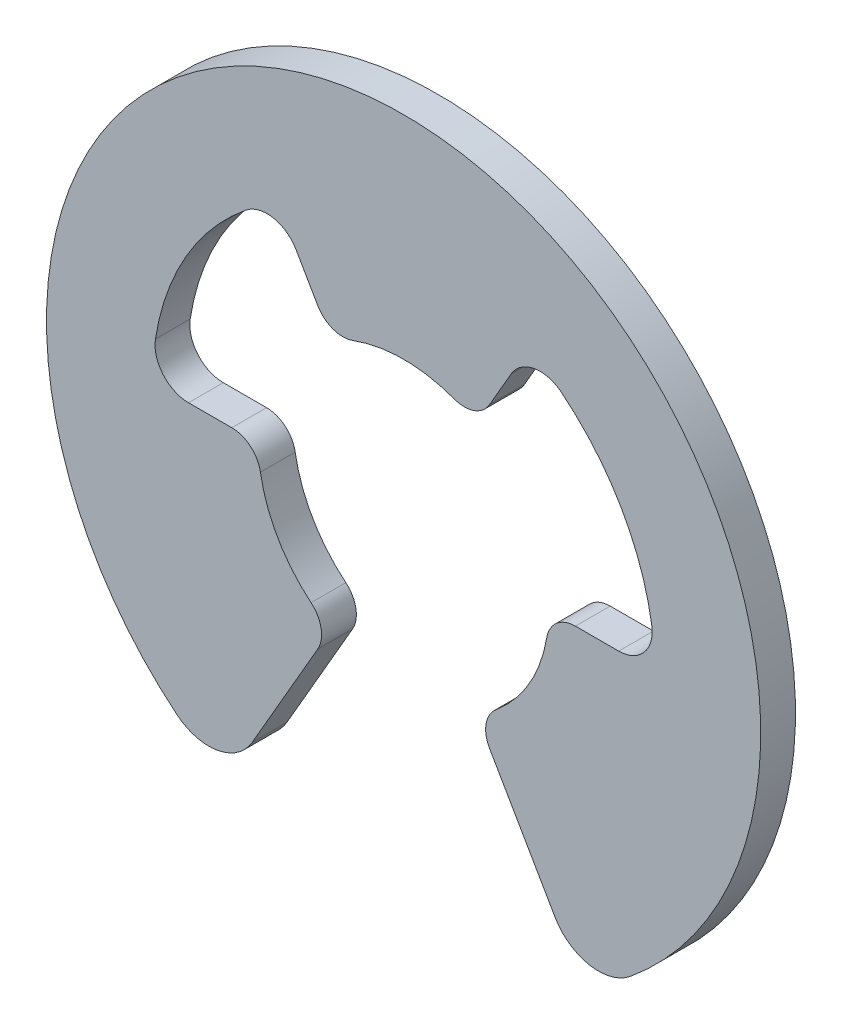
ISO-10303-21;
HEADER;
FILE_DESCRIPTION(('STEP AP214'),'2;1');
FILE_NAME('part.step','',(''),(''),'','','');
FILE_SCHEMA(('AUTOMOTIVE_DESIGN { 1 0 10303 214 1 1 1 1 }'));
ENDSEC;
DATA;
#1=APPLICATION_CONTEXT('core data for automotive mechanical design processes');
#2=APPLICATION_PROTOCOL_DEFINITION('international standard','automotive_design',2000,#1);
#3=PRODUCT_CONTEXT('',#1,'mechanical');
#4=PRODUCT('Part','Part','',(#3));
#5=PRODUCT_RELATED_PRODUCT_CATEGORY('part','',(#4));
#6=PRODUCT_DEFINITION_FORMATION('','',#4);
#7=PRODUCT_DEFINITION_CONTEXT('part definition',#1,'design');
#8=PRODUCT_DEFINITION('design','',#6,#7);
#9=PRODUCT_DEFINITION_SHAPE('','',#8);
#10=(LENGTH_UNIT() NAMED_UNIT(*) SI_UNIT(.MILLI.,.METRE.));
#11=(NAMED_UNIT(*) PLANE_ANGLE_UNIT() SI_UNIT($,.RADIAN.));
#12=(NAMED_UNIT(*) SI_UNIT($,.STERADIAN.) SOLID_ANGLE_UNIT());
#13=UNCERTAINTY_MEASURE_WITH_UNIT(LENGTH_MEASURE(1.E-05),#10,'distance_accuracy_value','');
#14=(GEOMETRIC_REPRESENTATION_CONTEXT(3) GLOBAL_UNCERTAINTY_ASSIGNED_CONTEXT((#13)) GLOBAL_UNIT_ASSIGNED_CONTEXT((#10,
#11,#12)) REPRESENTATION_CONTEXT('',''));
#15=CARTESIAN_POINT('',(0.,0.,0.));
#16=DIRECTION('',(0.,0.,1.));
#17=DIRECTION('',(1.,0.,0.));
#18=AXIS2_PLACEMENT_3D('',#15,#16,#17);
#19=CARTESIAN_POINT('',(5.19771588444956,-6.32300799517454,0.46355));
#20=DIRECTION('',(0.,0.,-1.));
#21=DIRECTION('',(-1.,0.,0.));
#22=AXIS2_PLACEMENT_3D('',#19,#20,#21);
#23=CYLINDRICAL_SURFACE('',#22,1.33984999999996);
#24=DIRECTION('',(0.,0.,-1.));
#25=VECTOR('',#24,1.);
#26=CARTESIAN_POINT('',(4.037371747189,-6.9929329951745,0.46355));
#27=LINE('',#26,#25);
#28=CARTESIAN_POINT('',(4.037371747189,-6.9929329951745,0.46355));
#29=VERTEX_POINT('',#28);
#30=CARTESIAN_POINT('',(4.037371747189,-6.9929329951745,-0.46355));
#31=VERTEX_POINT('',#30);
#32=EDGE_CURVE('E216',#29,#31,#27,.T.);
#33=ORIENTED_EDGE('',*,*,#32,.T.);
#34=CARTESIAN_POINT('',(5.19771588444956,-6.32300799517454,-0.46355));
#35=DIRECTION('',(0.,0.,1.));
#36=DIRECTION('',(1.,0.,0.));
#37=AXIS2_PLACEMENT_3D('',#34,#35,#36);
#38=CIRCLE('',#37,1.33984999999996);
#39=CARTESIAN_POINT('',(6.0485443880461,-7.35803885460221,-0.46355));
#40=VERTEX_POINT('',#39);
#41=EDGE_CURVE('E210',#31,#40,#38,.T.);
#42=ORIENTED_EDGE('',*,*,#41,.T.);
#43=DIRECTION('',(0.,0.,-1.));
#44=VECTOR('',#43,1.);
#45=CARTESIAN_POINT('',(6.0485443880461,-7.35803885460221,0.46355));
#46=LINE('',#45,#44);
#47=CARTESIAN_POINT('',(6.0485443880461,-7.35803885460221,0.46355));
#48=VERTEX_POINT('',#47);
#49=EDGE_CURVE('E11',#48,#40,#46,.T.);
#50=ORIENTED_EDGE('',*,*,#49,.F.);
#51=CARTESIAN_POINT('',(5.19771588444956,-6.32300799517454,0.46355));
#52=DIRECTION('',(0.,0.,1.));
#53=DIRECTION('',(1.,0.,0.));
#54=AXIS2_PLACEMENT_3D('',#51,#52,#53);
#55=CIRCLE('',#54,1.33984999999996);
#56=EDGE_CURVE('E282',#29,#48,#55,.T.);
#57=ORIENTED_EDGE('',*,*,#56,.F.);
#58=EDGE_LOOP('',(#33,#42,#50,#57));
#59=FACE_BOUND('',#58,.T.);
#60=ADVANCED_FACE('F38',(#59),#23,.T.);
#61=CARTESIAN_POINT('',(0.,0.,0.46355));
#62=DIRECTION('',(0.,0.,-1.));
#63=DIRECTION('',(-1.,0.,0.));
#64=AXIS2_PLACEMENT_3D('',#61,#62,#63);
#65=CYLINDRICAL_SURFACE('',#64,9.52499999999999);
#66=ORIENTED_EDGE('',*,*,#49,.T.);
#67=CARTESIAN_POINT('',(0.,0.,-0.46355));
#68=DIRECTION('',(0.,0.,1.));
#69=DIRECTION('',(1.,0.,0.));
#70=AXIS2_PLACEMENT_3D('',#67,#68,#69);
#71=CIRCLE('',#70,9.52499999999999);
#72=CARTESIAN_POINT('',(-6.04854447375821,-7.3580387841441,-0.46355));
#73=VERTEX_POINT('',#72);
#74=EDGE_CURVE('E200',#40,#73,#71,.T.);
#75=ORIENTED_EDGE('',*,*,#74,.T.);
#76=DIRECTION('',(0.,0.,-1.));
#77=VECTOR('',#76,1.);
#78=CARTESIAN_POINT('',(-6.04854447375821,-7.3580387841441,0.46355));
#79=LINE('',#78,#77);
#80=CARTESIAN_POINT('',(-6.04854447375821,-7.3580387841441,0.46355));
#81=VERTEX_POINT('',#80);
#82=EDGE_CURVE('E45',#81,#73,#79,.T.);
#83=ORIENTED_EDGE('',*,*,#82,.F.);
#84=CARTESIAN_POINT('',(0.,0.,0.46355));
#85=DIRECTION('',(0.,0.,1.));
#86=DIRECTION('',(1.,0.,0.));
#87=AXIS2_PLACEMENT_3D('',#84,#85,#86);
#88=CIRCLE('',#87,9.52499999999999);
#89=EDGE_CURVE('E201',#48,#81,#88,.T.);
#90=ORIENTED_EDGE('',*,*,#89,.F.);
#91=EDGE_LOOP('',(#66,#75,#83,#90));
#92=FACE_BOUND('',#91,.T.);
#93=ADVANCED_FACE('F198',(#92),#65,.T.);
#94=CARTESIAN_POINT('',(-5.19771588444956,-6.32300799517454,0.46355));
#95=DIRECTION('',(0.,0.,-1.));
#96=DIRECTION('',(-1.,0.,0.));
#97=AXIS2_PLACEMENT_3D('',#94,#95,#96);
#98=CYLINDRICAL_SURFACE('',#97,1.33984999999996);
#99=ORIENTED_EDGE('',*,*,#82,.T.);
#100=CARTESIAN_POINT('',(-5.19771588444956,-6.32300799517454,-0.46355));
#101=DIRECTION('',(0.,0.,1.));
#102=DIRECTION('',(1.,0.,0.));
#103=AXIS2_PLACEMENT_3D('',#100,#101,#102);
#104=CIRCLE('',#103,1.33984999999996);
#105=CARTESIAN_POINT('',(-4.037371747189,-6.9929329951745,-0.46355));
#106=VERTEX_POINT('',#105);
#107=EDGE_CURVE('E214',#73,#106,#104,.T.);
#108=ORIENTED_EDGE('',*,*,#107,.T.);
#109=DIRECTION('',(0.,0.,-1.));
#110=VECTOR('',#109,1.);
#111=CARTESIAN_POINT('',(-4.037371747189,-6.9929329951745,0.46355));
#112=LINE('',#111,#110);
#113=CARTESIAN_POINT('',(-4.037371747189,-6.9929329951745,0.46355));
#114=VERTEX_POINT('',#113);
#115=EDGE_CURVE('E368',#114,#106,#112,.T.);
#116=ORIENTED_EDGE('',*,*,#115,.F.);
#117=CARTESIAN_POINT('',(-5.19771588444956,-6.32300799517454,0.46355));
#118=DIRECTION('',(0.,0.,1.));
#119=DIRECTION('',(1.,0.,0.));
#120=AXIS2_PLACEMENT_3D('',#117,#118,#119);
#121=CIRCLE('',#120,1.33984999999996);
#122=EDGE_CURVE('E285',#81,#114,#121,.T.);
#123=ORIENTED_EDGE('',*,*,#122,.F.);
#124=EDGE_LOOP('',(#99,#108,#116,#123));
#125=FACE_BOUND('',#124,.T.);
#126=ADVANCED_FACE('F371',(#125),#98,.T.);
#127=CARTESIAN_POINT('',(-4.037371747189,-6.9929329951745,0.46355));
#128=DIRECTION('',(-0.866025403784439,0.499999999999998,0.));
#129=DIRECTION('',(-0.499999999999999,-0.86602540378444,0.));
#130=AXIS2_PLACEMENT_3D('',#127,#128,#129);
#131=PLANE('',#130);
#132=ORIENTED_EDGE('',*,*,#115,.T.);
#133=DIRECTION('',(0.499999999999998,0.866025403784439,0.));
#134=VECTOR('',#133,1.);
#135=CARTESIAN_POINT('',(-4.037371747189,-6.9929329951745,-0.46355));
#136=LINE('',#135,#134);
#137=CARTESIAN_POINT('',(-2.2915935039836,-3.9691563791944,-0.46355));
#138=VERTEX_POINT('',#137);
#139=EDGE_CURVE('E220',#106,#138,#136,.T.);
#140=ORIENTED_EDGE('',*,*,#139,.T.);
#141=DIRECTION('',(0.,0.,-1.));
#142=VECTOR('',#141,1.);
#143=CARTESIAN_POINT('',(-2.2915935039836,-3.9691563791944,0.46355));
#144=LINE('',#143,#142);
#145=CARTESIAN_POINT('',(-2.2915935039836,-3.9691563791944,0.46355));
#146=VERTEX_POINT('',#145);
#147=EDGE_CURVE('E366',#146,#138,#144,.T.);
#148=ORIENTED_EDGE('',*,*,#147,.F.);
#149=DIRECTION('',(0.499999999999998,0.866025403784439,0.));
#150=VECTOR('',#149,1.);
#151=CARTESIAN_POINT('',(-4.037371747189,-6.9929329951745,0.46355));
#152=LINE('',#151,#150);
#153=EDGE_CURVE('E287',#114,#146,#152,.T.);
#154=ORIENTED_EDGE('',*,*,#153,.F.);
#155=EDGE_LOOP('',(#132,#140,#148,#154));
#156=FACE_BOUND('',#155,.T.);
#157=ADVANCED_FACE('F379',(#156),#131,.F.);
#158=CARTESIAN_POINT('',(-2.9625033842955,-3.58180637919446,0.46355));
#159=DIRECTION('',(0.,0.,-1.));
#160=DIRECTION('',(-1.,0.,0.));
#161=AXIS2_PLACEMENT_3D('',#158,#159,#160);
#162=CYLINDRICAL_SURFACE('',#161,0.774700000000049);
#163=ORIENTED_EDGE('',*,*,#147,.T.);
#164=CARTESIAN_POINT('',(-2.9625033842955,-3.58180637919446,-0.46355));
#165=DIRECTION('',(0.,0.,1.));
#166=DIRECTION('',(1.,0.,0.));
#167=AXIS2_PLACEMENT_3D('',#164,#165,#166);
#168=CIRCLE('',#167,0.774700000000049);
#169=CARTESIAN_POINT('',(-2.4687528202462,-2.9848386493287,-0.46355));
#170=VERTEX_POINT('',#169);
#171=EDGE_CURVE('E223',#138,#170,#168,.T.);
#172=ORIENTED_EDGE('',*,*,#171,.T.);
#173=DIRECTION('',(0.,0.,-1.));
#174=VECTOR('',#173,1.);
#175=CARTESIAN_POINT('',(-2.4687528202462,-2.9848386493287,0.46355));
#176=LINE('',#175,#174);
#177=CARTESIAN_POINT('',(-2.4687528202462,-2.9848386493287,0.46355));
#178=VERTEX_POINT('',#177);
#179=EDGE_CURVE('E364',#178,#170,#176,.T.);
#180=ORIENTED_EDGE('',*,*,#179,.F.);
#181=CARTESIAN_POINT('',(-2.9625033842955,-3.58180637919446,0.46355));
#182=DIRECTION('',(0.,0.,1.));
#183=DIRECTION('',(1.,0.,0.));
#184=AXIS2_PLACEMENT_3D('',#181,#182,#183);
#185=CIRCLE('',#184,0.774700000000049);
#186=EDGE_CURVE('E289',#146,#178,#185,.T.);
#187=ORIENTED_EDGE('',*,*,#186,.F.);
#188=EDGE_LOOP('',(#163,#172,#180,#187));
#189=FACE_BOUND('',#188,.T.);
#190=ADVANCED_FACE('F382',(#189),#162,.T.);
#191=CARTESIAN_POINT('',(0.,0.,0.46355));
#192=DIRECTION('',(0.,0.,-1.));
#193=DIRECTION('',(-1.,0.,0.));
#194=AXIS2_PLACEMENT_3D('',#191,#192,#193);
#195=CYLINDRICAL_SURFACE('',#194,3.8735);
#196=ORIENTED_EDGE('',*,*,#179,.T.);
#197=CARTESIAN_POINT('',(0.,0.,-0.46355));
#198=DIRECTION('',(0.,0.,-1.));
#199=DIRECTION('',(-1.,0.,0.));
#200=AXIS2_PLACEMENT_3D('',#197,#198,#199);
#201=CIRCLE('',#200,3.8735);
#202=CARTESIAN_POINT('',(-3.8193225066394,-0.645583333333329,-0.46355));
#203=VERTEX_POINT('',#202);
#204=EDGE_CURVE('E226',#170,#203,#201,.T.);
#205=ORIENTED_EDGE('',*,*,#204,.T.);
#206=DIRECTION('',(0.,0.,-1.));
#207=VECTOR('',#206,1.);
#208=CARTESIAN_POINT('',(-3.8193225066394,-0.645583333333329,0.46355));
#209=LINE('',#208,#207);
#210=CARTESIAN_POINT('',(-3.8193225066394,-0.645583333333329,0.46355));
#211=VERTEX_POINT('',#210);
#212=EDGE_CURVE('E362',#211,#203,#209,.T.);
#213=ORIENTED_EDGE('',*,*,#212,.F.);
#214=CARTESIAN_POINT('',(0.,0.,0.46355));
#215=DIRECTION('',(0.,0.,-1.));
#216=DIRECTION('',(-1.,0.,0.));
#217=AXIS2_PLACEMENT_3D('',#214,#215,#216);
#218=CIRCLE('',#217,3.8735);
#219=EDGE_CURVE('E291',#178,#211,#218,.T.);
#220=ORIENTED_EDGE('',*,*,#219,.F.);
#221=EDGE_LOOP('',(#196,#205,#213,#220));
#222=FACE_BOUND('',#221,.T.);
#223=ADVANCED_FACE('F387',(#222),#195,.F.);
#224=CARTESIAN_POINT('',(-4.58318700796735,-0.774700000000079,0.46355));
#225=DIRECTION('',(0.,0.,-1.));
#226=DIRECTION('',(-1.,0.,0.));
#227=AXIS2_PLACEMENT_3D('',#224,#225,#226);
#228=CYLINDRICAL_SURFACE('',#227,0.774700000000079);
#229=ORIENTED_EDGE('',*,*,#212,.T.);
#230=CARTESIAN_POINT('',(-4.58318700796735,-0.774700000000079,-0.46355));
#231=DIRECTION('',(0.,0.,1.));
#232=DIRECTION('',(1.,0.,0.));
#233=AXIS2_PLACEMENT_3D('',#230,#231,#232);
#234=CIRCLE('',#233,0.774700000000079);
#235=CARTESIAN_POINT('',(-4.5831870079673,0.,-0.46355));
#236=VERTEX_POINT('',#235);
#237=EDGE_CURVE('E229',#203,#236,#234,.T.);
#238=ORIENTED_EDGE('',*,*,#237,.T.);
#239=DIRECTION('',(0.,0.,-1.));
#240=VECTOR('',#239,1.);
#241=CARTESIAN_POINT('',(-4.5831870079673,0.,0.46355));
#242=LINE('',#241,#240);
#243=CARTESIAN_POINT('',(-4.5831870079673,0.,0.46355));
#244=VERTEX_POINT('',#243);
#245=EDGE_CURVE('E360',#244,#236,#242,.T.);
#246=ORIENTED_EDGE('',*,*,#245,.F.);
#247=CARTESIAN_POINT('',(-4.58318700796735,-0.774700000000079,0.46355));
#248=DIRECTION('',(0.,0.,1.));
#249=DIRECTION('',(1.,0.,0.));
#250=AXIS2_PLACEMENT_3D('',#247,#248,#249);
#251=CIRCLE('',#250,0.774700000000079);
#252=EDGE_CURVE('E293',#211,#244,#251,.T.);
#253=ORIENTED_EDGE('',*,*,#252,.F.);
#254=EDGE_LOOP('',(#229,#238,#246,#253));
#255=FACE_BOUND('',#254,.T.);
#256=ADVANCED_FACE('F393',(#255),#228,.T.);
#257=CARTESIAN_POINT('',(-4.5831870079673,0.,0.46355));
#258=DIRECTION('',(0.,-1.,0.));
#259=DIRECTION('',(0.,0.,-1.));
#260=AXIS2_PLACEMENT_3D('',#257,#258,#259);
#261=PLANE('',#260);
#262=ORIENTED_EDGE('',*,*,#245,.T.);
#263=DIRECTION('',(-1.,0.,0.));
#264=VECTOR('',#263,1.);
#265=CARTESIAN_POINT('',(-4.5831870079673,0.,-0.46355));
#266=LINE('',#265,#264);
#267=CARTESIAN_POINT('',(-5.7368949568415,0.,-0.46355));
#268=VERTEX_POINT('',#267);
#269=EDGE_CURVE('E232',#236,#268,#266,.T.);
#270=ORIENTED_EDGE('',*,*,#269,.T.);
#271=DIRECTION('',(0.,0.,-1.));
#272=VECTOR('',#271,1.);
#273=CARTESIAN_POINT('',(-5.7368949568415,0.,0.46355));
#274=LINE('',#273,#272);
#275=CARTESIAN_POINT('',(-5.7368949568415,0.,0.46355));
#276=VERTEX_POINT('',#275);
#277=EDGE_CURVE('E358',#276,#268,#274,.T.);
#278=ORIENTED_EDGE('',*,*,#277,.F.);
#279=DIRECTION('',(-1.,0.,0.));
#280=VECTOR('',#279,1.);
#281=CARTESIAN_POINT('',(-4.5831870079673,0.,0.46355));
#282=LINE('',#281,#280);
#283=EDGE_CURVE('E295',#244,#276,#282,.T.);
#284=ORIENTED_EDGE('',*,*,#283,.F.);
#285=EDGE_LOOP('',(#262,#270,#278,#284));
#286=FACE_BOUND('',#285,.T.);
#287=ADVANCED_FACE('F397',(#286),#261,.F.);
#288=CARTESIAN_POINT('',(-5.73689495684144,0.893233333333414,0.46355));
#289=DIRECTION('',(0.,0.,-1.));
#290=DIRECTION('',(-1.,0.,0.));
#291=AXIS2_PLACEMENT_3D('',#288,#289,#290);
#292=CYLINDRICAL_SURFACE('',#291,0.893233333333415);
#293=ORIENTED_EDGE('',*,*,#277,.T.);
#294=CARTESIAN_POINT('',(-5.73689495684144,0.893233333333414,-0.46355));
#295=DIRECTION('',(0.,0.,-1.));
#296=DIRECTION('',(-1.,0.,0.));
#297=AXIS2_PLACEMENT_3D('',#294,#295,#296);
#298=CIRCLE('',#297,0.893233333333415);
#299=CARTESIAN_POINT('',(-6.619494180971,1.0306538461538,-0.46355));
#300=VERTEX_POINT('',#299);
#301=EDGE_CURVE('E235',#268,#300,#298,.T.);
#302=ORIENTED_EDGE('',*,*,#301,.T.);
#303=DIRECTION('',(0.,0.,-1.));
#304=VECTOR('',#303,1.);
#305=CARTESIAN_POINT('',(-6.619494180971,1.0306538461538,0.46355));
#306=LINE('',#305,#304);
#307=CARTESIAN_POINT('',(-6.619494180971,1.0306538461538,0.46355));
#308=VERTEX_POINT('',#307);
#309=EDGE_CURVE('E356',#308,#300,#306,.T.);
#310=ORIENTED_EDGE('',*,*,#309,.F.);
#311=CARTESIAN_POINT('',(-5.73689495684144,0.893233333333414,0.46355));
#312=DIRECTION('',(0.,0.,-1.));
#313=DIRECTION('',(-1.,0.,0.));
#314=AXIS2_PLACEMENT_3D('',#311,#312,#313);
#315=CIRCLE('',#314,0.893233333333415);
#316=EDGE_CURVE('E297',#276,#308,#315,.T.);
#317=ORIENTED_EDGE('',*,*,#316,.F.);
#318=EDGE_LOOP('',(#293,#302,#310,#317));
#319=FACE_BOUND('',#318,.T.);
#320=ADVANCED_FACE('F402',(#319),#292,.F.);
#321=CARTESIAN_POINT('',(0.,0.,0.46355));
#322=DIRECTION('',(0.,0.,-1.));
#323=DIRECTION('',(-1.,0.,0.));
#324=AXIS2_PLACEMENT_3D('',#321,#322,#323);
#325=CYLINDRICAL_SURFACE('',#324,6.69925000000001);
#326=ORIENTED_EDGE('',*,*,#309,.T.);
#327=CARTESIAN_POINT('',(0.,0.,-0.46355));
#328=DIRECTION('',(0.,0.,-1.));
#329=DIRECTION('',(-1.,0.,0.));
#330=AXIS2_PLACEMENT_3D('',#327,#328,#329);
#331=CIRCLE('',#330,6.69925000000001);
#332=CARTESIAN_POINT('',(-4.20231950376282,5.21732319784723,-0.46355));
#333=VERTEX_POINT('',#332);
#334=EDGE_CURVE('E238',#300,#333,#331,.T.);
#335=ORIENTED_EDGE('',*,*,#334,.T.);
#336=DIRECTION('',(0.,0.,-1.));
#337=VECTOR('',#336,1.);
#338=CARTESIAN_POINT('',(-4.20231950376282,5.21732319784723,0.46355));
#339=LINE('',#338,#337);
#340=CARTESIAN_POINT('',(-4.20231950376282,5.21732319784723,0.46355));
#341=VERTEX_POINT('',#340);
#342=EDGE_CURVE('E354',#341,#333,#339,.T.);
#343=ORIENTED_EDGE('',*,*,#342,.F.);
#344=CARTESIAN_POINT('',(0.,0.,0.46355));
#345=DIRECTION('',(0.,0.,-1.));
#346=DIRECTION('',(-1.,0.,0.));
#347=AXIS2_PLACEMENT_3D('',#344,#345,#346);
#348=CIRCLE('',#347,6.69925000000001);
#349=EDGE_CURVE('E299',#308,#341,#348,.T.);
#350=ORIENTED_EDGE('',*,*,#349,.F.);
#351=EDGE_LOOP('',(#326,#335,#343,#350));
#352=FACE_BOUND('',#351,.T.);
#353=ADVANCED_FACE('F408',(#352),#325,.F.);
#354=CARTESIAN_POINT('',(-3.64201023659443,4.52168010480081,0.46355));
#355=DIRECTION('',(0.,0.,-1.));
#356=DIRECTION('',(-1.,0.,0.));
#357=AXIS2_PLACEMENT_3D('',#354,#355,#356);
#358=CYLINDRICAL_SURFACE('',#357,0.893233333333402);
#359=ORIENTED_EDGE('',*,*,#342,.T.);
#360=CARTESIAN_POINT('',(-3.64201023659443,4.52168010480081,-0.46355));
#361=DIRECTION('',(0.,0.,-1.));
#362=DIRECTION('',(-1.,0.,0.));
#363=AXIS2_PLACEMENT_3D('',#360,#361,#362);
#364=CIRCLE('',#363,0.893233333333402);
#365=CARTESIAN_POINT('',(-2.8684474784207,4.9682967714676,-0.46355));
#366=VERTEX_POINT('',#365);
#367=EDGE_CURVE('E241',#333,#366,#364,.T.);
#368=ORIENTED_EDGE('',*,*,#367,.T.);
#369=DIRECTION('',(0.,0.,-1.));
#370=VECTOR('',#369,1.);
#371=CARTESIAN_POINT('',(-2.8684474784207,4.9682967714676,0.46355));
#372=LINE('',#371,#370);
#373=CARTESIAN_POINT('',(-2.8684474784207,4.9682967714676,0.46355));
#374=VERTEX_POINT('',#373);
#375=EDGE_CURVE('E352',#374,#366,#372,.T.);
#376=ORIENTED_EDGE('',*,*,#375,.F.);
#377=CARTESIAN_POINT('',(-3.64201023659443,4.52168010480081,0.46355));
#378=DIRECTION('',(0.,0.,-1.));
#379=DIRECTION('',(-1.,0.,0.));
#380=AXIS2_PLACEMENT_3D('',#377,#378,#379);
#381=CIRCLE('',#380,0.893233333333402);
#382=EDGE_CURVE('E301',#341,#374,#381,.T.);
#383=ORIENTED_EDGE('',*,*,#382,.F.);
#384=EDGE_LOOP('',(#359,#368,#376,#383));
#385=FACE_BOUND('',#384,.T.);
#386=ADVANCED_FACE('F412',(#385),#358,.F.);
#387=CARTESIAN_POINT('',(-2.8684474784207,4.9682967714676,0.46355));
#388=DIRECTION('',(0.866025403784461,0.499999999999961,0.));
#389=DIRECTION('',(-0.499999999999961,0.866025403784461,0.));
#390=AXIS2_PLACEMENT_3D('',#387,#388,#389);
#391=PLANE('',#390);
#392=ORIENTED_EDGE('',*,*,#375,.T.);
#393=DIRECTION('',(0.499999999999961,-0.866025403784461,0.));
#394=VECTOR('',#393,1.);
#395=CARTESIAN_POINT('',(-2.8684474784207,4.9682967714676,-0.46355));
#396=LINE('',#395,#394);
#397=CARTESIAN_POINT('',(-2.2915935039836,3.9691563791944,-0.46355));
#398=VERTEX_POINT('',#397);
#399=EDGE_CURVE('E244',#366,#398,#396,.T.);
#400=ORIENTED_EDGE('',*,*,#399,.T.);
#401=DIRECTION('',(0.,0.,-1.));
#402=VECTOR('',#401,1.);
#403=CARTESIAN_POINT('',(-2.2915935039836,3.9691563791944,0.46355));
#404=LINE('',#403,#402);
#405=CARTESIAN_POINT('',(-2.2915935039836,3.9691563791944,0.46355));
#406=VERTEX_POINT('',#405);
#407=EDGE_CURVE('E350',#406,#398,#404,.T.);
#408=ORIENTED_EDGE('',*,*,#407,.F.);
#409=DIRECTION('',(0.499999999999961,-0.866025403784461,0.));
#410=VECTOR('',#409,1.);
#411=CARTESIAN_POINT('',(-2.8684474784207,4.9682967714676,0.46355));
#412=LINE('',#411,#410);
#413=EDGE_CURVE('E303',#374,#406,#412,.T.);
#414=ORIENTED_EDGE('',*,*,#413,.F.);
#415=EDGE_LOOP('',(#392,#400,#408,#414));
#416=FACE_BOUND('',#415,.T.);
#417=ADVANCED_FACE('F417',(#416),#391,.F.);
#418=CARTESIAN_POINT('',(-1.62068362367182,4.35650637919444,0.46355));
#419=DIRECTION('',(0.,0.,-1.));
#420=DIRECTION('',(-1.,0.,0.));
#421=AXIS2_PLACEMENT_3D('',#418,#419,#420);
#422=CYLINDRICAL_SURFACE('',#421,0.774699999999995);
#423=ORIENTED_EDGE('',*,*,#407,.T.);
#424=CARTESIAN_POINT('',(-1.62068362367182,4.35650637919444,-0.46355));
#425=DIRECTION('',(0.,0.,1.));
#426=DIRECTION('',(1.,0.,0.));
#427=AXIS2_PLACEMENT_3D('',#424,#425,#426);
#428=CIRCLE('',#427,0.774699999999995);
#429=CARTESIAN_POINT('',(-1.3505696449148,3.6304219980926,-0.46355));
#430=VERTEX_POINT('',#429);
#431=EDGE_CURVE('E247',#398,#430,#428,.T.);
#432=ORIENTED_EDGE('',*,*,#431,.T.);
#433=DIRECTION('',(0.,0.,-1.));
#434=VECTOR('',#433,1.);
#435=CARTESIAN_POINT('',(-1.3505696449148,3.6304219980926,0.46355));
#436=LINE('',#435,#434);
#437=CARTESIAN_POINT('',(-1.3505696449148,3.6304219980926,0.46355));
#438=VERTEX_POINT('',#437);
#439=EDGE_CURVE('E348',#438,#430,#436,.T.);
#440=ORIENTED_EDGE('',*,*,#439,.F.);
#441=CARTESIAN_POINT('',(-1.62068362367182,4.35650637919444,0.46355));
#442=DIRECTION('',(0.,0.,1.));
#443=DIRECTION('',(1.,0.,0.));
#444=AXIS2_PLACEMENT_3D('',#441,#442,#443);
#445=CIRCLE('',#444,0.774699999999995);
#446=EDGE_CURVE('E305',#406,#438,#445,.T.);
#447=ORIENTED_EDGE('',*,*,#446,.F.);
#448=EDGE_LOOP('',(#423,#432,#440,#447));
#449=FACE_BOUND('',#448,.T.);
#450=ADVANCED_FACE('F423',(#449),#422,.T.);
#451=CARTESIAN_POINT('',(0.,0.,0.46355));
#452=DIRECTION('',(0.,0.,-1.));
#453=DIRECTION('',(-1.,0.,0.));
#454=AXIS2_PLACEMENT_3D('',#451,#452,#453);
#455=CYLINDRICAL_SURFACE('',#454,3.87349999999997);
#456=ORIENTED_EDGE('',*,*,#439,.T.);
#457=CARTESIAN_POINT('',(0.,0.,-0.46355));
#458=DIRECTION('',(0.,0.,-1.));
#459=DIRECTION('',(-1.,0.,0.));
#460=AXIS2_PLACEMENT_3D('',#457,#458,#459);
#461=CIRCLE('',#460,3.87349999999997);
#462=CARTESIAN_POINT('',(1.3505696863932,3.63042198266201,-0.46355));
#463=VERTEX_POINT('',#462);
#464=EDGE_CURVE('E250',#430,#463,#461,.T.);
#465=ORIENTED_EDGE('',*,*,#464,.T.);
#466=DIRECTION('',(0.,0.,-1.));
#467=VECTOR('',#466,1.);
#468=CARTESIAN_POINT('',(1.3505696863932,3.63042198266201,0.46355));
#469=LINE('',#468,#467);
#470=CARTESIAN_POINT('',(1.3505696863932,3.63042198266201,0.46355));
#471=VERTEX_POINT('',#470);
#472=EDGE_CURVE('E346',#471,#463,#469,.T.);
#473=ORIENTED_EDGE('',*,*,#472,.F.);
#474=CARTESIAN_POINT('',(0.,0.,0.46355));
#475=DIRECTION('',(0.,0.,-1.));
#476=DIRECTION('',(-1.,0.,0.));
#477=AXIS2_PLACEMENT_3D('',#474,#475,#476);
#478=CIRCLE('',#477,3.87349999999997);
#479=EDGE_CURVE('E307',#438,#471,#478,.T.);
#480=ORIENTED_EDGE('',*,*,#479,.F.);
#481=EDGE_LOOP('',(#456,#465,#473,#480));
#482=FACE_BOUND('',#481,.T.);
#483=ADVANCED_FACE('F427',(#482),#455,.F.);
#484=CARTESIAN_POINT('',(1.62068362367178,4.35650637919449,0.46355));
#485=DIRECTION('',(0.,0.,-1.));
#486=DIRECTION('',(-1.,0.,0.));
#487=AXIS2_PLACEMENT_3D('',#484,#485,#486);
#488=CYLINDRICAL_SURFACE('',#487,0.774700000000058);
#489=ORIENTED_EDGE('',*,*,#472,.T.);
#490=CARTESIAN_POINT('',(1.62068362367178,4.35650637919449,-0.46355));
#491=DIRECTION('',(0.,0.,1.));
#492=DIRECTION('',(1.,0.,0.));
#493=AXIS2_PLACEMENT_3D('',#490,#491,#492);
#494=CIRCLE('',#493,0.774700000000058);
#495=CARTESIAN_POINT('',(2.2915935039836,3.9691563791944,-0.46355));
#496=VERTEX_POINT('',#495);
#497=EDGE_CURVE('E253',#463,#496,#494,.T.);
#498=ORIENTED_EDGE('',*,*,#497,.T.);
#499=DIRECTION('',(0.,0.,-1.));
#500=VECTOR('',#499,1.);
#501=CARTESIAN_POINT('',(2.2915935039836,3.9691563791944,0.46355));
#502=LINE('',#501,#500);
#503=CARTESIAN_POINT('',(2.2915935039836,3.9691563791944,0.46355));
#504=VERTEX_POINT('',#503);
#505=EDGE_CURVE('E344',#504,#496,#502,.T.);
#506=ORIENTED_EDGE('',*,*,#505,.F.);
#507=CARTESIAN_POINT('',(1.62068362367178,4.35650637919449,0.46355));
#508=DIRECTION('',(0.,0.,1.));
#509=DIRECTION('',(1.,0.,0.));
#510=AXIS2_PLACEMENT_3D('',#507,#508,#509);
#511=CIRCLE('',#510,0.774700000000058);
#512=EDGE_CURVE('E309',#471,#504,#511,.T.);
#513=ORIENTED_EDGE('',*,*,#512,.F.);
#514=EDGE_LOOP('',(#489,#498,#506,#513));
#515=FACE_BOUND('',#514,.T.);
#516=ADVANCED_FACE('F432',(#515),#488,.T.);
#517=CARTESIAN_POINT('',(2.2915935039836,3.9691563791944,0.46355));
#518=DIRECTION('',(-0.866025403784461,0.499999999999961,0.));
#519=DIRECTION('',(-0.499999999999961,-0.866025403784461,0.));
#520=AXIS2_PLACEMENT_3D('',#517,#518,#519);
#521=PLANE('',#520);
#522=ORIENTED_EDGE('',*,*,#505,.T.);
#523=DIRECTION('',(0.499999999999961,0.866025403784461,0.));
#524=VECTOR('',#523,1.);
#525=CARTESIAN_POINT('',(2.2915935039836,3.9691563791944,-0.46355));
#526=LINE('',#525,#524);
#527=CARTESIAN_POINT('',(2.8684474784207,4.9682967714676,-0.46355));
#528=VERTEX_POINT('',#527);
#529=EDGE_CURVE('E256',#496,#528,#526,.T.);
#530=ORIENTED_EDGE('',*,*,#529,.T.);
#531=DIRECTION('',(0.,0.,-1.));
#532=VECTOR('',#531,1.);
#533=CARTESIAN_POINT('',(2.8684474784207,4.9682967714676,0.46355));
#534=LINE('',#533,#532);
#535=CARTESIAN_POINT('',(2.8684474784207,4.9682967714676,0.46355));
#536=VERTEX_POINT('',#535);
#537=EDGE_CURVE('E342',#536,#528,#534,.T.);
#538=ORIENTED_EDGE('',*,*,#537,.F.);
#539=DIRECTION('',(0.499999999999961,0.866025403784461,0.));
#540=VECTOR('',#539,1.);
#541=CARTESIAN_POINT('',(2.2915935039836,3.9691563791944,0.46355));
#542=LINE('',#541,#540);
#543=EDGE_CURVE('E311',#504,#536,#542,.T.);
#544=ORIENTED_EDGE('',*,*,#543,.F.);
#545=EDGE_LOOP('',(#522,#530,#538,#544));
#546=FACE_BOUND('',#545,.T.);
#547=ADVANCED_FACE('F438',(#546),#521,.F.);
#548=CARTESIAN_POINT('',(3.64201023659443,4.52168010480081,0.46355));
#549=DIRECTION('',(0.,0.,-1.));
#550=DIRECTION('',(-1.,0.,0.));
#551=AXIS2_PLACEMENT_3D('',#548,#549,#550);
#552=CYLINDRICAL_SURFACE('',#551,0.893233333333402);
#553=ORIENTED_EDGE('',*,*,#537,.T.);
#554=CARTESIAN_POINT('',(3.64201023659443,4.52168010480081,-0.46355));
#555=DIRECTION('',(0.,0.,-1.));
#556=DIRECTION('',(-1.,0.,0.));
#557=AXIS2_PLACEMENT_3D('',#554,#555,#556);
#558=CIRCLE('',#557,0.893233333333402);
#559=CARTESIAN_POINT('',(4.2023195037628,5.2173231978472,-0.46355));
#560=VERTEX_POINT('',#559);
#561=EDGE_CURVE('E259',#528,#560,#558,.T.);
#562=ORIENTED_EDGE('',*,*,#561,.T.);
#563=DIRECTION('',(0.,0.,-1.));
#564=VECTOR('',#563,1.);
#565=CARTESIAN_POINT('',(4.2023195037628,5.2173231978472,0.46355));
#566=LINE('',#565,#564);
#567=CARTESIAN_POINT('',(4.2023195037628,5.2173231978472,0.46355));
#568=VERTEX_POINT('',#567);
#569=EDGE_CURVE('E340',#568,#560,#566,.T.);
#570=ORIENTED_EDGE('',*,*,#569,.F.);
#571=CARTESIAN_POINT('',(3.64201023659443,4.52168010480081,0.46355));
#572=DIRECTION('',(0.,0.,-1.));
#573=DIRECTION('',(-1.,0.,0.));
#574=AXIS2_PLACEMENT_3D('',#571,#572,#573);
#575=CIRCLE('',#574,0.893233333333402);
#576=EDGE_CURVE('E313',#536,#568,#575,.T.);
#577=ORIENTED_EDGE('',*,*,#576,.F.);
#578=EDGE_LOOP('',(#553,#562,#570,#577));
#579=FACE_BOUND('',#578,.T.);
#580=ADVANCED_FACE('F442',(#579),#552,.F.);
#581=CARTESIAN_POINT('',(0.,0.,0.46355));
#582=DIRECTION('',(0.,0.,-1.));
#583=DIRECTION('',(-1.,0.,0.));
#584=AXIS2_PLACEMENT_3D('',#581,#582,#583);
#585=CYLINDRICAL_SURFACE('',#584,6.69924999999996);
#586=ORIENTED_EDGE('',*,*,#569,.T.);
#587=CARTESIAN_POINT('',(0.,0.,-0.46355));
#588=DIRECTION('',(0.,0.,-1.));
#589=DIRECTION('',(-1.,0.,0.));
#590=AXIS2_PLACEMENT_3D('',#587,#588,#589);
#591=CIRCLE('',#590,6.69924999999996);
#592=CARTESIAN_POINT('',(6.61949418097092,1.0306538461538,-0.46355));
#593=VERTEX_POINT('',#592);
#594=EDGE_CURVE('E262',#560,#593,#591,.T.);
#595=ORIENTED_EDGE('',*,*,#594,.T.);
#596=DIRECTION('',(0.,0.,-1.));
#597=VECTOR('',#596,1.);
#598=CARTESIAN_POINT('',(6.61949418097092,1.0306538461538,0.46355));
#599=LINE('',#598,#597);
#600=CARTESIAN_POINT('',(6.61949418097092,1.0306538461538,0.46355));
#601=VERTEX_POINT('',#600);
#602=EDGE_CURVE('E338',#601,#593,#599,.T.);
#603=ORIENTED_EDGE('',*,*,#602,.F.);
#604=CARTESIAN_POINT('',(0.,0.,0.46355));
#605=DIRECTION('',(0.,0.,-1.));
#606=DIRECTION('',(-1.,0.,0.));
#607=AXIS2_PLACEMENT_3D('',#604,#605,#606);
#608=CIRCLE('',#607,6.69924999999996);
#609=EDGE_CURVE('E315',#568,#601,#608,.T.);
#610=ORIENTED_EDGE('',*,*,#609,.F.);
#611=EDGE_LOOP('',(#586,#595,#603,#610));
#612=FACE_BOUND('',#611,.T.);
#613=ADVANCED_FACE('F447',(#612),#585,.F.);
#614=CARTESIAN_POINT('',(5.7368949568415,0.893233333333272,0.46355));
#615=DIRECTION('',(0.,0.,-1.));
#616=DIRECTION('',(-1.,0.,0.));
#617=AXIS2_PLACEMENT_3D('',#614,#615,#616);
#618=CYLINDRICAL_SURFACE('',#617,0.893233333333273);
#619=ORIENTED_EDGE('',*,*,#602,.T.);
#620=CARTESIAN_POINT('',(5.7368949568415,0.893233333333272,-0.46355));
#621=DIRECTION('',(0.,0.,-1.));
#622=DIRECTION('',(-1.,0.,0.));
#623=AXIS2_PLACEMENT_3D('',#620,#621,#622);
#624=CIRCLE('',#623,0.893233333333273);
#625=CARTESIAN_POINT('',(5.7368949568415,0.,-0.46355));
#626=VERTEX_POINT('',#625);
#627=EDGE_CURVE('E265',#593,#626,#624,.T.);
#628=ORIENTED_EDGE('',*,*,#627,.T.);
#629=DIRECTION('',(0.,0.,-1.));
#630=VECTOR('',#629,1.);
#631=CARTESIAN_POINT('',(5.7368949568415,0.,0.46355));
#632=LINE('',#631,#630);
#633=CARTESIAN_POINT('',(5.7368949568415,0.,0.46355));
#634=VERTEX_POINT('',#633);
#635=EDGE_CURVE('E336',#634,#626,#632,.T.);
#636=ORIENTED_EDGE('',*,*,#635,.F.);
#637=CARTESIAN_POINT('',(5.7368949568415,0.893233333333272,0.46355));
#638=DIRECTION('',(0.,0.,-1.));
#639=DIRECTION('',(-1.,0.,0.));
#640=AXIS2_PLACEMENT_3D('',#637,#638,#639);
#641=CIRCLE('',#640,0.893233333333273);
#642=EDGE_CURVE('E317',#601,#634,#641,.T.);
#643=ORIENTED_EDGE('',*,*,#642,.F.);
#644=EDGE_LOOP('',(#619,#628,#636,#643));
#645=FACE_BOUND('',#644,.T.);
#646=ADVANCED_FACE('F453',(#645),#618,.F.);
#647=CARTESIAN_POINT('',(5.7368949568415,0.,0.46355));
#648=DIRECTION('',(0.,-1.,0.));
#649=DIRECTION('',(0.,0.,-1.));
#650=AXIS2_PLACEMENT_3D('',#647,#648,#649);
#651=PLANE('',#650);
#652=ORIENTED_EDGE('',*,*,#635,.T.);
#653=DIRECTION('',(-1.,0.,0.));
#654=VECTOR('',#653,1.);
#655=CARTESIAN_POINT('',(5.7368949568415,0.,-0.46355));
#656=LINE('',#655,#654);
#657=CARTESIAN_POINT('',(4.5831870079673,0.,-0.46355));
#658=VERTEX_POINT('',#657);
#659=EDGE_CURVE('E268',#626,#658,#656,.T.);
#660=ORIENTED_EDGE('',*,*,#659,.T.);
#661=DIRECTION('',(0.,0.,-1.));
#662=VECTOR('',#661,1.);
#663=CARTESIAN_POINT('',(4.5831870079673,0.,0.46355));
#664=LINE('',#663,#662);
#665=CARTESIAN_POINT('',(4.5831870079673,0.,0.46355));
#666=VERTEX_POINT('',#665);
#667=EDGE_CURVE('E334',#666,#658,#664,.T.);
#668=ORIENTED_EDGE('',*,*,#667,.F.);
#669=DIRECTION('',(-1.,0.,0.));
#670=VECTOR('',#669,1.);
#671=CARTESIAN_POINT('',(5.7368949568415,0.,0.46355));
#672=LINE('',#671,#670);
#673=EDGE_CURVE('E319',#634,#666,#672,.T.);
#674=ORIENTED_EDGE('',*,*,#673,.F.);
#675=EDGE_LOOP('',(#652,#660,#668,#674));
#676=FACE_BOUND('',#675,.T.);
#677=ADVANCED_FACE('F457',(#676),#651,.F.);
#678=CARTESIAN_POINT('',(4.58318700796735,-0.774700000000083,0.46355));
#679=DIRECTION('',(0.,0.,-1.));
#680=DIRECTION('',(-1.,0.,0.));
#681=AXIS2_PLACEMENT_3D('',#678,#679,#680);
#682=CYLINDRICAL_SURFACE('',#681,0.774700000000083);
#683=ORIENTED_EDGE('',*,*,#667,.T.);
#684=CARTESIAN_POINT('',(4.58318700796735,-0.774700000000083,-0.46355));
#685=DIRECTION('',(0.,0.,1.));
#686=DIRECTION('',(1.,0.,0.));
#687=AXIS2_PLACEMENT_3D('',#684,#685,#686);
#688=CIRCLE('',#687,0.774700000000083);
#689=CARTESIAN_POINT('',(3.8193225026968,-0.64558335665806,-0.46355));
#690=VERTEX_POINT('',#689);
#691=EDGE_CURVE('E271',#658,#690,#688,.T.);
#692=ORIENTED_EDGE('',*,*,#691,.T.);
#693=DIRECTION('',(0.,0.,-1.));
#694=VECTOR('',#693,1.);
#695=CARTESIAN_POINT('',(3.8193225026968,-0.64558335665806,0.46355));
#696=LINE('',#695,#694);
#697=CARTESIAN_POINT('',(3.8193225026968,-0.64558335665806,0.46355));
#698=VERTEX_POINT('',#697);
#699=EDGE_CURVE('E332',#698,#690,#696,.T.);
#700=ORIENTED_EDGE('',*,*,#699,.F.);
#701=CARTESIAN_POINT('',(4.58318700796735,-0.774700000000083,0.46355));
#702=DIRECTION('',(0.,0.,1.));
#703=DIRECTION('',(1.,0.,0.));
#704=AXIS2_PLACEMENT_3D('',#701,#702,#703);
#705=CIRCLE('',#704,0.774700000000083);
#706=EDGE_CURVE('E321',#666,#698,#705,.T.);
#707=ORIENTED_EDGE('',*,*,#706,.F.);
#708=EDGE_LOOP('',(#683,#692,#700,#707));
#709=FACE_BOUND('',#708,.T.);
#710=ADVANCED_FACE('F462',(#709),#682,.T.);
#711=CARTESIAN_POINT('',(0.,0.,0.46355));
#712=DIRECTION('',(0.,0.,-1.));
#713=DIRECTION('',(-1.,0.,0.));
#714=AXIS2_PLACEMENT_3D('',#711,#712,#713);
#715=CYLINDRICAL_SURFACE('',#714,3.8735);
#716=ORIENTED_EDGE('',*,*,#699,.T.);
#717=CARTESIAN_POINT('',(0.,0.,-0.46355));
#718=DIRECTION('',(0.,0.,-1.));
#719=DIRECTION('',(-1.,0.,0.));
#720=AXIS2_PLACEMENT_3D('',#717,#718,#719);
#721=CIRCLE('',#720,3.8735);
#722=CARTESIAN_POINT('',(2.4687528202462,-2.9848386493287,-0.46355));
#723=VERTEX_POINT('',#722);
#724=EDGE_CURVE('E274',#690,#723,#721,.T.);
#725=ORIENTED_EDGE('',*,*,#724,.T.);
#726=DIRECTION('',(0.,0.,-1.));
#727=VECTOR('',#726,1.);
#728=CARTESIAN_POINT('',(2.4687528202462,-2.9848386493287,0.46355));
#729=LINE('',#728,#727);
#730=CARTESIAN_POINT('',(2.4687528202462,-2.9848386493287,0.46355));
#731=VERTEX_POINT('',#730);
#732=EDGE_CURVE('E330',#731,#723,#729,.T.);
#733=ORIENTED_EDGE('',*,*,#732,.F.);
#734=CARTESIAN_POINT('',(0.,0.,0.46355));
#735=DIRECTION('',(0.,0.,-1.));
#736=DIRECTION('',(-1.,0.,0.));
#737=AXIS2_PLACEMENT_3D('',#734,#735,#736);
#738=CIRCLE('',#737,3.8735);
#739=EDGE_CURVE('E323',#698,#731,#738,.T.);
#740=ORIENTED_EDGE('',*,*,#739,.F.);
#741=EDGE_LOOP('',(#716,#725,#733,#740));
#742=FACE_BOUND('',#741,.T.);
#743=ADVANCED_FACE('F466',(#742),#715,.F.);
#744=CARTESIAN_POINT('',(2.9625033842955,-3.58180637919446,0.46355));
#745=DIRECTION('',(0.,0.,-1.));
#746=DIRECTION('',(-1.,0.,0.));
#747=AXIS2_PLACEMENT_3D('',#744,#745,#746);
#748=CYLINDRICAL_SURFACE('',#747,0.774700000000049);
#749=ORIENTED_EDGE('',*,*,#732,.T.);
#750=CARTESIAN_POINT('',(2.9625033842955,-3.58180637919446,-0.46355));
#751=DIRECTION('',(0.,0.,1.));
#752=DIRECTION('',(1.,0.,0.));
#753=AXIS2_PLACEMENT_3D('',#750,#751,#752);
#754=CIRCLE('',#753,0.774700000000049);
#755=CARTESIAN_POINT('',(2.2915935039836,-3.9691563791944,-0.46355));
#756=VERTEX_POINT('',#755);
#757=EDGE_CURVE('E277',#723,#756,#754,.T.);
#758=ORIENTED_EDGE('',*,*,#757,.T.);
#759=DIRECTION('',(0.,0.,-1.));
#760=VECTOR('',#759,1.);
#761=CARTESIAN_POINT('',(2.2915935039836,-3.9691563791944,0.46355));
#762=LINE('',#761,#760);
#763=CARTESIAN_POINT('',(2.2915935039836,-3.9691563791944,0.46355));
#764=VERTEX_POINT('',#763);
#765=EDGE_CURVE('E328',#764,#756,#762,.T.);
#766=ORIENTED_EDGE('',*,*,#765,.F.);
#767=CARTESIAN_POINT('',(2.9625033842955,-3.58180637919446,0.46355));
#768=DIRECTION('',(0.,0.,1.));
#769=DIRECTION('',(1.,0.,0.));
#770=AXIS2_PLACEMENT_3D('',#767,#768,#769);
#771=CIRCLE('',#770,0.774700000000049);
#772=EDGE_CURVE('E57',#731,#764,#771,.T.);
#773=ORIENTED_EDGE('',*,*,#772,.F.);
#774=EDGE_LOOP('',(#749,#758,#766,#773));
#775=FACE_BOUND('',#774,.T.);
#776=ADVANCED_FACE('F470',(#775),#748,.T.);
#777=CARTESIAN_POINT('',(2.2915935039836,-3.9691563791944,0.46355));
#778=DIRECTION('',(0.866025403784439,0.499999999999998,0.));
#779=DIRECTION('',(-0.499999999999999,0.86602540378444,0.));
#780=AXIS2_PLACEMENT_3D('',#777,#778,#779);
#781=PLANE('',#780);
#782=ORIENTED_EDGE('',*,*,#765,.T.);
#783=DIRECTION('',(0.499999999999998,-0.866025403784439,0.));
#784=VECTOR('',#783,1.);
#785=CARTESIAN_POINT('',(2.2915935039836,-3.9691563791944,-0.46355));
#786=LINE('',#785,#784);
#787=EDGE_CURVE('E280',#756,#31,#786,.T.);
#788=ORIENTED_EDGE('',*,*,#787,.T.);
#789=ORIENTED_EDGE('',*,*,#32,.F.);
#790=DIRECTION('',(0.499999999999998,-0.866025403784439,0.));
#791=VECTOR('',#790,1.);
#792=CARTESIAN_POINT('',(2.2915935039836,-3.9691563791944,0.46355));
#793=LINE('',#792,#791);
#794=EDGE_CURVE('E52',#764,#29,#793,.T.);
#795=ORIENTED_EDGE('',*,*,#794,.F.);
#796=EDGE_LOOP('',(#782,#788,#789,#795));
#797=FACE_BOUND('',#796,.T.);
#798=ADVANCED_FACE('F472',(#797),#781,.F.);
#799=CARTESIAN_POINT('',(5.19771588444956,-6.32300799517454,0.46355));
#800=DIRECTION('',(0.,0.,1.));
#801=DIRECTION('',(1.,0.,0.));
#802=AXIS2_PLACEMENT_3D('',#799,#800,#801);
#803=PLANE('',#802);
#804=ORIENTED_EDGE('',*,*,#56,.T.);
#805=ORIENTED_EDGE('',*,*,#89,.T.);
#806=ORIENTED_EDGE('',*,*,#122,.T.);
#807=ORIENTED_EDGE('',*,*,#153,.T.);
#808=ORIENTED_EDGE('',*,*,#186,.T.);
#809=ORIENTED_EDGE('',*,*,#219,.T.);
#810=ORIENTED_EDGE('',*,*,#252,.T.);
#811=ORIENTED_EDGE('',*,*,#283,.T.);
#812=ORIENTED_EDGE('',*,*,#316,.T.);
#813=ORIENTED_EDGE('',*,*,#349,.T.);
#814=ORIENTED_EDGE('',*,*,#382,.T.);
#815=ORIENTED_EDGE('',*,*,#413,.T.);
#816=ORIENTED_EDGE('',*,*,#446,.T.);
#817=ORIENTED_EDGE('',*,*,#479,.T.);
#818=ORIENTED_EDGE('',*,*,#512,.T.);
#819=ORIENTED_EDGE('',*,*,#543,.T.);
#820=ORIENTED_EDGE('',*,*,#576,.T.);
#821=ORIENTED_EDGE('',*,*,#609,.T.);
#822=ORIENTED_EDGE('',*,*,#642,.T.);
#823=ORIENTED_EDGE('',*,*,#673,.T.);
#824=ORIENTED_EDGE('',*,*,#706,.T.);
#825=ORIENTED_EDGE('',*,*,#739,.T.);
#826=ORIENTED_EDGE('',*,*,#772,.T.);
#827=ORIENTED_EDGE('',*,*,#794,.T.);
#828=EDGE_LOOP('',(#804,#805,#806,#807,#808,#809,#810,#811,#812,#813,#814,#815,#816,#817,#818,
#819,#820,#821,#822,#823,#824,#825,#826,#827));
#829=FACE_BOUND('',#828,.T.);
#830=ADVANCED_FACE('F374',(#829),#803,.T.);
#831=CARTESIAN_POINT('',(5.19771588444956,-6.32300799517454,-0.46355));
#832=DIRECTION('',(0.,0.,1.));
#833=DIRECTION('',(1.,0.,0.));
#834=AXIS2_PLACEMENT_3D('',#831,#832,#833);
#835=PLANE('',#834);
#836=ORIENTED_EDGE('',*,*,#41,.F.);
#837=ORIENTED_EDGE('',*,*,#787,.F.);
#838=ORIENTED_EDGE('',*,*,#757,.F.);
#839=ORIENTED_EDGE('',*,*,#724,.F.);
#840=ORIENTED_EDGE('',*,*,#691,.F.);
#841=ORIENTED_EDGE('',*,*,#659,.F.);
#842=ORIENTED_EDGE('',*,*,#627,.F.);
#843=ORIENTED_EDGE('',*,*,#594,.F.);
#844=ORIENTED_EDGE('',*,*,#561,.F.);
#845=ORIENTED_EDGE('',*,*,#529,.F.);
#846=ORIENTED_EDGE('',*,*,#497,.F.);
#847=ORIENTED_EDGE('',*,*,#464,.F.);
#848=ORIENTED_EDGE('',*,*,#431,.F.);
#849=ORIENTED_EDGE('',*,*,#399,.F.);
#850=ORIENTED_EDGE('',*,*,#367,.F.);
#851=ORIENTED_EDGE('',*,*,#334,.F.);
#852=ORIENTED_EDGE('',*,*,#301,.F.);
#853=ORIENTED_EDGE('',*,*,#269,.F.);
#854=ORIENTED_EDGE('',*,*,#237,.F.);
#855=ORIENTED_EDGE('',*,*,#204,.F.);
#856=ORIENTED_EDGE('',*,*,#171,.F.);
#857=ORIENTED_EDGE('',*,*,#139,.F.);
#858=ORIENTED_EDGE('',*,*,#107,.F.);
#859=ORIENTED_EDGE('',*,*,#74,.F.);
#860=EDGE_LOOP('',(#836,#837,#838,#839,#840,#841,#842,#843,#844,#845,#846,#847,#848,#849,#850,
#851,#852,#853,#854,#855,#856,#857,#858,#859));
#861=FACE_BOUND('',#860,.T.);
#862=ADVANCED_FACE('F208',(#861),#835,.F.);
#863=CLOSED_SHELL('',(#60,#93,#126,#157,#190,#223,#256,#287,#320,#353,#386,#417,#450,#483,#516,
#547,#580,#613,#646,#677,#710,#743,#776,#798,#830,#862));
#864=MANIFOLD_SOLID_BREP('B2',#863);
#865=ADVANCED_BREP_SHAPE_REPRESENTATION('',(#18,#864),#14);
#866=SHAPE_DEFINITION_REPRESENTATION(#9,#865);
ENDSEC;
END-ISO-10303-21;
